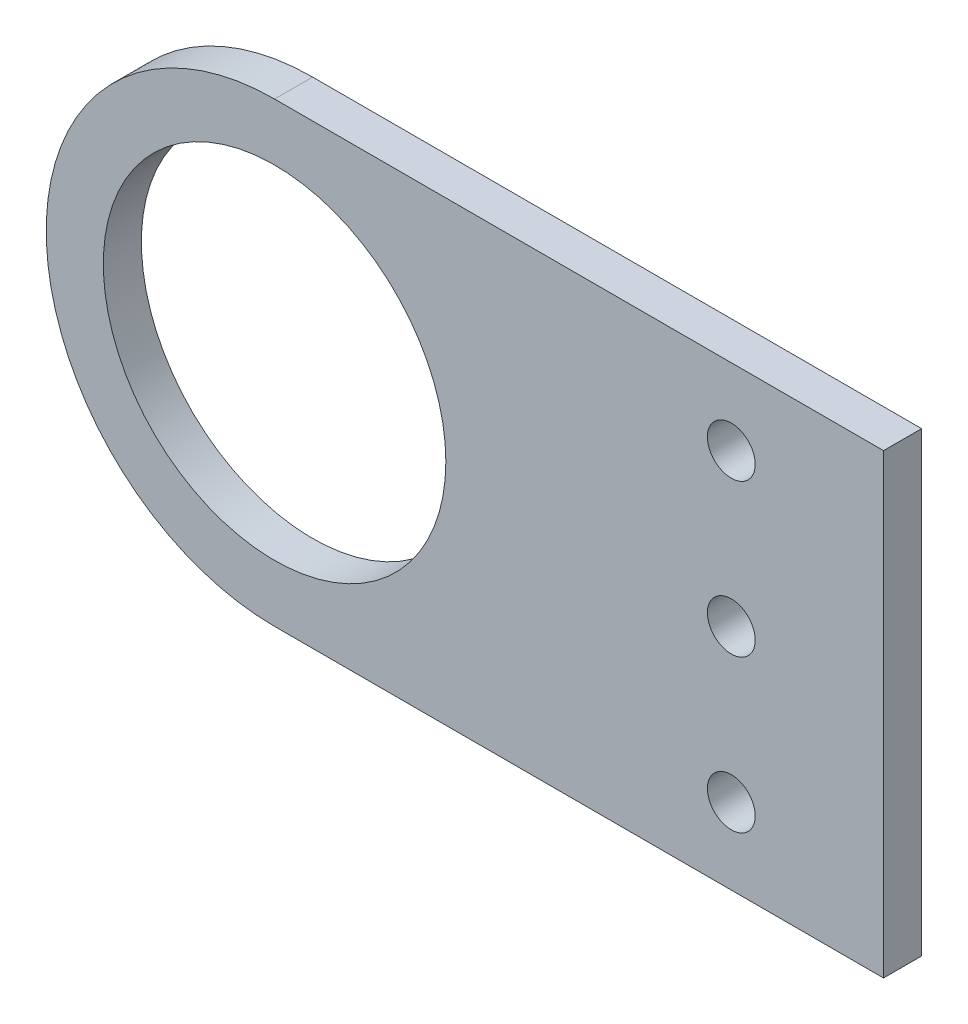
ISO-10303-21;
HEADER;
FILE_DESCRIPTION(('STEP AP214'),'2;1');
FILE_NAME('part.step','',(''),(''),'','','');
FILE_SCHEMA(('AUTOMOTIVE_DESIGN { 1 0 10303 214 1 1 1 1 }'));
ENDSEC;
DATA;
#1=APPLICATION_CONTEXT('core data for automotive mechanical design processes');
#2=APPLICATION_PROTOCOL_DEFINITION('international standard','automotive_design',2000,#1);
#3=PRODUCT_CONTEXT('',#1,'mechanical');
#4=PRODUCT('Part','Part','',(#3));
#5=PRODUCT_RELATED_PRODUCT_CATEGORY('part','',(#4));
#6=PRODUCT_DEFINITION_FORMATION('','',#4);
#7=PRODUCT_DEFINITION_CONTEXT('part definition',#1,'design');
#8=PRODUCT_DEFINITION('design','',#6,#7);
#9=PRODUCT_DEFINITION_SHAPE('','',#8);
#10=(LENGTH_UNIT() NAMED_UNIT(*) SI_UNIT(.MILLI.,.METRE.));
#11=(NAMED_UNIT(*) PLANE_ANGLE_UNIT() SI_UNIT($,.RADIAN.));
#12=(NAMED_UNIT(*) SI_UNIT($,.STERADIAN.) SOLID_ANGLE_UNIT());
#13=UNCERTAINTY_MEASURE_WITH_UNIT(LENGTH_MEASURE(1.E-05),#10,'distance_accuracy_value','');
#14=(GEOMETRIC_REPRESENTATION_CONTEXT(3) GLOBAL_UNCERTAINTY_ASSIGNED_CONTEXT((#13)) GLOBAL_UNIT_ASSIGNED_CONTEXT((#10,
#11,#12)) REPRESENTATION_CONTEXT('',''));
#15=CARTESIAN_POINT('',(0.,0.,0.));
#16=DIRECTION('',(0.,0.,1.));
#17=DIRECTION('',(1.,0.,0.));
#18=AXIS2_PLACEMENT_3D('',#15,#16,#17);
#19=CARTESIAN_POINT('',(0.,0.,3.175));
#20=DIRECTION('',(0.,0.,1.));
#21=DIRECTION('',(1.,0.,0.));
#22=AXIS2_PLACEMENT_3D('',#19,#20,#21);
#23=PLANE('',#22);
#24=CARTESIAN_POINT('',(38.1,0.,3.175));
#25=DIRECTION('',(0.,0.,1.));
#26=DIRECTION('',(1.,0.,0.));
#27=AXIS2_PLACEMENT_3D('',#24,#25,#26);
#28=CIRCLE('',#27,1.9939);
#29=CARTESIAN_POINT('',(40.0939,0.,3.175));
#30=VERTEX_POINT('',#29);
#31=EDGE_CURVE('E119',#30,#30,#28,.T.);
#32=ORIENTED_EDGE('',*,*,#31,.F.);
#33=EDGE_LOOP('',(#32));
#34=FACE_BOUND('',#33,.T.);
#35=CARTESIAN_POINT('',(0.,0.,3.175));
#36=DIRECTION('',(0.,0.,1.));
#37=DIRECTION('',(1.,0.,0.));
#38=AXIS2_PLACEMENT_3D('',#35,#36,#37);
#39=CIRCLE('',#38,14.2875);
#40=CARTESIAN_POINT('',(14.2875,0.,3.175));
#41=VERTEX_POINT('',#40);
#42=EDGE_CURVE('E101',#41,#41,#39,.T.);
#43=ORIENTED_EDGE('',*,*,#42,.F.);
#44=EDGE_LOOP('',(#43));
#45=FACE_BOUND('',#44,.T.);
#46=DIRECTION('',(0.,1.,0.));
#47=VECTOR('',#46,1.);
#48=CARTESIAN_POINT('',(50.8,-19.05,3.175));
#49=LINE('',#48,#47);
#50=CARTESIAN_POINT('',(50.8,-19.05,3.175));
#51=VERTEX_POINT('',#50);
#52=CARTESIAN_POINT('',(50.8,19.05,3.175));
#53=VERTEX_POINT('',#52);
#54=EDGE_CURVE('E84',#51,#53,#49,.T.);
#55=ORIENTED_EDGE('',*,*,#54,.T.);
#56=DIRECTION('',(-1.,0.,0.));
#57=VECTOR('',#56,1.);
#58=CARTESIAN_POINT('',(25.4,19.05,3.175));
#59=LINE('',#58,#57);
#60=CARTESIAN_POINT('',(0.,19.05,3.175));
#61=VERTEX_POINT('',#60);
#62=EDGE_CURVE('E78',#53,#61,#59,.T.);
#63=ORIENTED_EDGE('',*,*,#62,.T.);
#64=CARTESIAN_POINT('',(0.,0.,3.175));
#65=DIRECTION('',(0.,0.,1.));
#66=DIRECTION('',(1.,0.,0.));
#67=AXIS2_PLACEMENT_3D('',#64,#65,#66);
#68=CIRCLE('',#67,19.05);
#69=CARTESIAN_POINT('',(0.,-19.05,3.175));
#70=VERTEX_POINT('',#69);
#71=EDGE_CURVE('E81',#61,#70,#68,.T.);
#72=ORIENTED_EDGE('',*,*,#71,.T.);
#73=DIRECTION('',(1.,0.,0.));
#74=VECTOR('',#73,1.);
#75=CARTESIAN_POINT('',(0.,-19.05,3.175));
#76=LINE('',#75,#74);
#77=EDGE_CURVE('E50',#70,#51,#76,.T.);
#78=ORIENTED_EDGE('',*,*,#77,.T.);
#79=EDGE_LOOP('',(#55,#63,#72,#78));
#80=FACE_BOUND('',#79,.T.);
#81=CARTESIAN_POINT('',(38.1000000000001,-12.7,3.175));
#82=DIRECTION('',(0.,0.,1.));
#83=DIRECTION('',(1.,0.,0.));
#84=AXIS2_PLACEMENT_3D('',#81,#82,#83);
#85=CIRCLE('',#84,1.99389999999996);
#86=CARTESIAN_POINT('',(40.0939,-12.7,3.175));
#87=VERTEX_POINT('',#86);
#88=EDGE_CURVE('E113',#87,#87,#85,.T.);
#89=ORIENTED_EDGE('',*,*,#88,.F.);
#90=EDGE_LOOP('',(#89));
#91=FACE_BOUND('',#90,.T.);
#92=CARTESIAN_POINT('',(38.0999999999999,12.7,3.175));
#93=DIRECTION('',(0.,0.,1.));
#94=DIRECTION('',(1.,0.,0.));
#95=AXIS2_PLACEMENT_3D('',#92,#93,#94);
#96=CIRCLE('',#95,1.9939);
#97=CARTESIAN_POINT('',(40.0938999999999,12.7,3.175));
#98=VERTEX_POINT('',#97);
#99=EDGE_CURVE('E125',#98,#98,#96,.T.);
#100=ORIENTED_EDGE('',*,*,#99,.F.);
#101=EDGE_LOOP('',(#100));
#102=FACE_BOUND('',#101,.T.);
#103=ADVANCED_FACE('F33',(#34,#45,#80,#91,#102),#23,.T.);
#104=CARTESIAN_POINT('',(0.,0.,0.));
#105=DIRECTION('',(0.,0.,1.));
#106=DIRECTION('',(1.,0.,0.));
#107=AXIS2_PLACEMENT_3D('',#104,#105,#106);
#108=PLANE('',#107);
#109=DIRECTION('',(0.,1.,0.));
#110=VECTOR('',#109,1.);
#111=CARTESIAN_POINT('',(50.8,-19.05,0.));
#112=LINE('',#111,#110);
#113=CARTESIAN_POINT('',(50.8,-19.05,0.));
#114=VERTEX_POINT('',#113);
#115=CARTESIAN_POINT('',(50.8,19.05,0.));
#116=VERTEX_POINT('',#115);
#117=EDGE_CURVE('E98',#114,#116,#112,.T.);
#118=ORIENTED_EDGE('',*,*,#117,.F.);
#119=DIRECTION('',(1.,0.,0.));
#120=VECTOR('',#119,1.);
#121=CARTESIAN_POINT('',(25.4,-19.05,0.));
#122=LINE('',#121,#120);
#123=CARTESIAN_POINT('',(0.,-19.05,0.));
#124=VERTEX_POINT('',#123);
#125=EDGE_CURVE('E67',#124,#114,#122,.T.);
#126=ORIENTED_EDGE('',*,*,#125,.F.);
#127=CARTESIAN_POINT('',(0.,0.,0.));
#128=DIRECTION('',(0.,0.,1.));
#129=DIRECTION('',(1.,0.,0.));
#130=AXIS2_PLACEMENT_3D('',#127,#128,#129);
#131=CIRCLE('',#130,19.05);
#132=CARTESIAN_POINT('',(0.,19.05,0.));
#133=VERTEX_POINT('',#132);
#134=EDGE_CURVE('E103',#133,#124,#131,.T.);
#135=ORIENTED_EDGE('',*,*,#134,.F.);
#136=DIRECTION('',(-1.,0.,0.));
#137=VECTOR('',#136,1.);
#138=CARTESIAN_POINT('',(0.,19.05,0.));
#139=LINE('',#138,#137);
#140=EDGE_CURVE('E89',#116,#133,#139,.T.);
#141=ORIENTED_EDGE('',*,*,#140,.F.);
#142=EDGE_LOOP('',(#118,#126,#135,#141));
#143=FACE_BOUND('',#142,.T.);
#144=CARTESIAN_POINT('',(0.,0.,0.));
#145=DIRECTION('',(0.,0.,1.));
#146=DIRECTION('',(1.,0.,0.));
#147=AXIS2_PLACEMENT_3D('',#144,#145,#146);
#148=CIRCLE('',#147,14.2875);
#149=CARTESIAN_POINT('',(14.2875,0.,0.));
#150=VERTEX_POINT('',#149);
#151=EDGE_CURVE('E110',#150,#150,#148,.T.);
#152=ORIENTED_EDGE('',*,*,#151,.T.);
#153=EDGE_LOOP('',(#152));
#154=FACE_BOUND('',#153,.T.);
#155=CARTESIAN_POINT('',(38.1000000000001,-12.7,0.));
#156=DIRECTION('',(0.,0.,1.));
#157=DIRECTION('',(1.,0.,0.));
#158=AXIS2_PLACEMENT_3D('',#155,#156,#157);
#159=CIRCLE('',#158,1.99389999999996);
#160=CARTESIAN_POINT('',(40.0939,-12.7,0.));
#161=VERTEX_POINT('',#160);
#162=EDGE_CURVE('E116',#161,#161,#159,.T.);
#163=ORIENTED_EDGE('',*,*,#162,.T.);
#164=EDGE_LOOP('',(#163));
#165=FACE_BOUND('',#164,.T.);
#166=CARTESIAN_POINT('',(38.1,0.,0.));
#167=DIRECTION('',(0.,0.,1.));
#168=DIRECTION('',(1.,0.,0.));
#169=AXIS2_PLACEMENT_3D('',#166,#167,#168);
#170=CIRCLE('',#169,1.9939);
#171=CARTESIAN_POINT('',(40.0939,0.,0.));
#172=VERTEX_POINT('',#171);
#173=EDGE_CURVE('E122',#172,#172,#170,.T.);
#174=ORIENTED_EDGE('',*,*,#173,.T.);
#175=EDGE_LOOP('',(#174));
#176=FACE_BOUND('',#175,.T.);
#177=CARTESIAN_POINT('',(38.0999999999999,12.7,0.));
#178=DIRECTION('',(0.,0.,1.));
#179=DIRECTION('',(1.,0.,0.));
#180=AXIS2_PLACEMENT_3D('',#177,#178,#179);
#181=CIRCLE('',#180,1.9939);
#182=CARTESIAN_POINT('',(40.0938999999999,12.7,0.));
#183=VERTEX_POINT('',#182);
#184=EDGE_CURVE('E128',#183,#183,#181,.T.);
#185=ORIENTED_EDGE('',*,*,#184,.T.);
#186=EDGE_LOOP('',(#185));
#187=FACE_BOUND('',#186,.T.);
#188=ADVANCED_FACE('F138',(#143,#154,#165,#176,#187),#108,.F.);
#189=CARTESIAN_POINT('',(50.8,-19.05,3.175));
#190=DIRECTION('',(-1.,0.,0.));
#191=DIRECTION('',(0.,0.,1.));
#192=AXIS2_PLACEMENT_3D('',#189,#190,#191);
#193=PLANE('',#192);
#194=ORIENTED_EDGE('',*,*,#117,.T.);
#195=DIRECTION('',(0.,0.,-1.));
#196=VECTOR('',#195,1.);
#197=CARTESIAN_POINT('',(50.8,19.05,3.175));
#198=LINE('',#197,#196);
#199=EDGE_CURVE('E11',#53,#116,#198,.T.);
#200=ORIENTED_EDGE('',*,*,#199,.F.);
#201=ORIENTED_EDGE('',*,*,#54,.F.);
#202=DIRECTION('',(0.,0.,-1.));
#203=VECTOR('',#202,1.);
#204=CARTESIAN_POINT('',(50.8,-19.05,3.175));
#205=LINE('',#204,#203);
#206=EDGE_CURVE('E94',#51,#114,#205,.T.);
#207=ORIENTED_EDGE('',*,*,#206,.T.);
#208=EDGE_LOOP('',(#194,#200,#201,#207));
#209=FACE_BOUND('',#208,.T.);
#210=ADVANCED_FACE('F35',(#209),#193,.F.);
#211=CARTESIAN_POINT('',(0.,19.05,3.175));
#212=DIRECTION('',(0.,-1.,0.));
#213=DIRECTION('',(0.,0.,-1.));
#214=AXIS2_PLACEMENT_3D('',#211,#212,#213);
#215=PLANE('',#214);
#216=ORIENTED_EDGE('',*,*,#140,.T.);
#217=DIRECTION('',(0.,0.,-1.));
#218=VECTOR('',#217,1.);
#219=CARTESIAN_POINT('',(0.,19.05,3.175));
#220=LINE('',#219,#218);
#221=EDGE_CURVE('E42',#61,#133,#220,.T.);
#222=ORIENTED_EDGE('',*,*,#221,.F.);
#223=ORIENTED_EDGE('',*,*,#62,.F.);
#224=ORIENTED_EDGE('',*,*,#199,.T.);
#225=EDGE_LOOP('',(#216,#222,#223,#224));
#226=FACE_BOUND('',#225,.T.);
#227=ADVANCED_FACE('F88',(#226),#215,.F.);
#228=CARTESIAN_POINT('',(0.,0.,3.175));
#229=DIRECTION('',(0.,0.,-1.));
#230=DIRECTION('',(-1.,0.,0.));
#231=AXIS2_PLACEMENT_3D('',#228,#229,#230);
#232=CYLINDRICAL_SURFACE('',#231,19.05);
#233=ORIENTED_EDGE('',*,*,#134,.T.);
#234=DIRECTION('',(0.,0.,-1.));
#235=VECTOR('',#234,1.);
#236=CARTESIAN_POINT('',(0.,-19.05,3.175));
#237=LINE('',#236,#235);
#238=EDGE_CURVE('E91',#70,#124,#237,.T.);
#239=ORIENTED_EDGE('',*,*,#238,.F.);
#240=ORIENTED_EDGE('',*,*,#71,.F.);
#241=ORIENTED_EDGE('',*,*,#221,.T.);
#242=EDGE_LOOP('',(#233,#239,#240,#241));
#243=FACE_BOUND('',#242,.T.);
#244=ADVANCED_FACE('F92',(#243),#232,.T.);
#245=CARTESIAN_POINT('',(25.4,-19.05,3.175));
#246=DIRECTION('',(0.,1.,0.));
#247=DIRECTION('',(0.,0.,1.));
#248=AXIS2_PLACEMENT_3D('',#245,#246,#247);
#249=PLANE('',#248);
#250=ORIENTED_EDGE('',*,*,#125,.T.);
#251=ORIENTED_EDGE('',*,*,#206,.F.);
#252=ORIENTED_EDGE('',*,*,#77,.F.);
#253=ORIENTED_EDGE('',*,*,#238,.T.);
#254=EDGE_LOOP('',(#250,#251,#252,#253));
#255=FACE_BOUND('',#254,.T.);
#256=ADVANCED_FACE('F107',(#255),#249,.F.);
#257=CARTESIAN_POINT('',(0.,0.,3.175));
#258=DIRECTION('',(0.,0.,-1.));
#259=DIRECTION('',(-1.,0.,0.));
#260=AXIS2_PLACEMENT_3D('',#257,#258,#259);
#261=CYLINDRICAL_SURFACE('',#260,14.2875);
#262=ORIENTED_EDGE('',*,*,#42,.T.);
#263=EDGE_LOOP('',(#262));
#264=FACE_BOUND('',#263,.T.);
#265=ORIENTED_EDGE('',*,*,#151,.F.);
#266=EDGE_LOOP('',(#265));
#267=FACE_BOUND('',#266,.T.);
#268=ADVANCED_FACE('F148',(#264,#267),#261,.F.);
#269=CARTESIAN_POINT('',(38.1000000000001,-12.7,3.175));
#270=DIRECTION('',(0.,0.,-1.));
#271=DIRECTION('',(-1.,0.,0.));
#272=AXIS2_PLACEMENT_3D('',#269,#270,#271);
#273=CYLINDRICAL_SURFACE('',#272,1.99389999999996);
#274=ORIENTED_EDGE('',*,*,#88,.T.);
#275=EDGE_LOOP('',(#274));
#276=FACE_BOUND('',#275,.T.);
#277=ORIENTED_EDGE('',*,*,#162,.F.);
#278=EDGE_LOOP('',(#277));
#279=FACE_BOUND('',#278,.T.);
#280=ADVANCED_FACE('F200',(#276,#279),#273,.F.);
#281=CARTESIAN_POINT('',(38.1,0.,3.175));
#282=DIRECTION('',(0.,0.,-1.));
#283=DIRECTION('',(-1.,0.,0.));
#284=AXIS2_PLACEMENT_3D('',#281,#282,#283);
#285=CYLINDRICAL_SURFACE('',#284,1.9939);
#286=ORIENTED_EDGE('',*,*,#31,.T.);
#287=EDGE_LOOP('',(#286));
#288=FACE_BOUND('',#287,.T.);
#289=ORIENTED_EDGE('',*,*,#173,.F.);
#290=EDGE_LOOP('',(#289));
#291=FACE_BOUND('',#290,.T.);
#292=ADVANCED_FACE('F208',(#288,#291),#285,.F.);
#293=CARTESIAN_POINT('',(38.0999999999999,12.7,3.175));
#294=DIRECTION('',(0.,0.,-1.));
#295=DIRECTION('',(-1.,0.,0.));
#296=AXIS2_PLACEMENT_3D('',#293,#294,#295);
#297=CYLINDRICAL_SURFACE('',#296,1.9939);
#298=ORIENTED_EDGE('',*,*,#99,.T.);
#299=EDGE_LOOP('',(#298));
#300=FACE_BOUND('',#299,.T.);
#301=ORIENTED_EDGE('',*,*,#184,.F.);
#302=EDGE_LOOP('',(#301));
#303=FACE_BOUND('',#302,.T.);
#304=ADVANCED_FACE('F134',(#300,#303),#297,.F.);
#305=CLOSED_SHELL('',(#103,#188,#210,#227,#244,#256,#268,#280,#292,#304));
#306=MANIFOLD_SOLID_BREP('B2',#305);
#307=ADVANCED_BREP_SHAPE_REPRESENTATION('',(#18,#306),#14);
#308=SHAPE_DEFINITION_REPRESENTATION(#9,#307);
ENDSEC;
END-ISO-10303-21;
